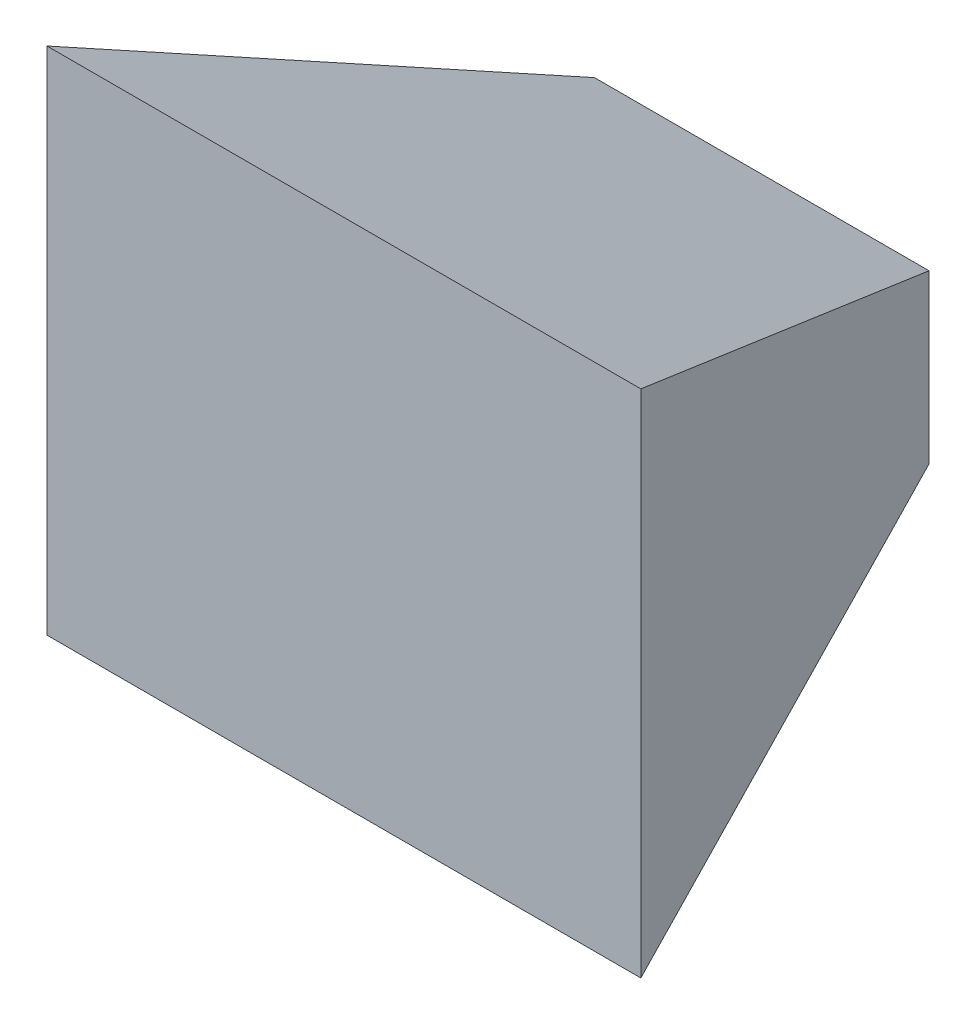
ISO-10303-21;
HEADER;
FILE_DESCRIPTION(('STEP AP214'),'2;1');
FILE_NAME('part.step','',(''),(''),'','','');
FILE_SCHEMA(('AUTOMOTIVE_DESIGN { 1 0 10303 214 1 1 1 1 }'));
ENDSEC;
DATA;
#1=APPLICATION_CONTEXT('core data for automotive mechanical design processes');
#2=APPLICATION_PROTOCOL_DEFINITION('international standard','automotive_design',2000,#1);
#3=PRODUCT_CONTEXT('',#1,'mechanical');
#4=PRODUCT('Part','Part','',(#3));
#5=PRODUCT_RELATED_PRODUCT_CATEGORY('part','',(#4));
#6=PRODUCT_DEFINITION_FORMATION('','',#4);
#7=PRODUCT_DEFINITION_CONTEXT('part definition',#1,'design');
#8=PRODUCT_DEFINITION('design','',#6,#7);
#9=PRODUCT_DEFINITION_SHAPE('','',#8);
#10=(LENGTH_UNIT() NAMED_UNIT(*) SI_UNIT(.MILLI.,.METRE.));
#11=(NAMED_UNIT(*) PLANE_ANGLE_UNIT() SI_UNIT($,.RADIAN.));
#12=(NAMED_UNIT(*) SI_UNIT($,.STERADIAN.) SOLID_ANGLE_UNIT());
#13=UNCERTAINTY_MEASURE_WITH_UNIT(LENGTH_MEASURE(1.E-05),#10,'distance_accuracy_value','');
#14=(GEOMETRIC_REPRESENTATION_CONTEXT(3) GLOBAL_UNCERTAINTY_ASSIGNED_CONTEXT((#13)) GLOBAL_UNIT_ASSIGNED_CONTEXT((#10,
#11,#12)) REPRESENTATION_CONTEXT('',''));
#15=CARTESIAN_POINT('',(0.,0.,0.));
#16=DIRECTION('',(0.,0.,1.));
#17=DIRECTION('',(1.,0.,0.));
#18=AXIS2_PLACEMENT_3D('',#15,#16,#17);
#19=CARTESIAN_POINT('',(177.5,50.,-249.787409610653));
#20=DIRECTION('',(0.,-0.925138554113529,0.37962962962963));
#21=DIRECTION('',(0.,-0.37962962962963,-0.925138554113529));
#22=AXIS2_PLACEMENT_3D('',#19,#20,#21);
#23=PLANE('',#22);
#24=DIRECTION('',(0.27589637888379,-0.364895210781787,-0.889231507126984));
#25=VECTOR('',#24,1.);
#26=CARTESIAN_POINT('',(-78.8770297029704,22.0631683168317,-317.868081014237));
#27=LINE('',#26,#25);
#28=CARTESIAN_POINT('',(-177.5,152.5,0.));
#29=VERTEX_POINT('',#28);
#30=CARTESIAN_POINT('',(-100.,50.,-249.787409610653));
#31=VERTEX_POINT('',#30);
#32=EDGE_CURVE('E76',#29,#31,#27,.T.);
#33=ORIENTED_EDGE('',*,*,#32,.F.);
#34=DIRECTION('',(-1.,0.,0.));
#35=VECTOR('',#34,1.);
#36=CARTESIAN_POINT('',(177.5,152.5,0.));
#37=LINE('',#36,#35);
#38=CARTESIAN_POINT('',(177.5,152.5,0.));
#39=VERTEX_POINT('',#38);
#40=EDGE_CURVE('E11',#39,#29,#37,.T.);
#41=ORIENTED_EDGE('',*,*,#40,.F.);
#42=DIRECTION('',(-0.27589637888379,-0.364895210781788,-0.889231507126984));
#43=VECTOR('',#42,1.);
#44=CARTESIAN_POINT('',(105.899207920792,57.8021782178218,-230.77388876821));
#45=LINE('',#44,#43);
#46=CARTESIAN_POINT('',(100.,50.,-249.787409610653));
#47=VERTEX_POINT('',#46);
#48=EDGE_CURVE('E52',#39,#47,#45,.T.);
#49=ORIENTED_EDGE('',*,*,#48,.T.);
#50=DIRECTION('',(-1.,0.,0.));
#51=VECTOR('',#50,1.);
#52=CARTESIAN_POINT('',(177.5,50.,-249.787409610653));
#53=LINE('',#52,#51);
#54=EDGE_CURVE('E89',#47,#31,#53,.T.);
#55=ORIENTED_EDGE('',*,*,#54,.T.);
#56=EDGE_LOOP('',(#33,#41,#49,#55));
#57=FACE_BOUND('',#56,.T.);
#58=ADVANCED_FACE('F38',(#57),#23,.F.);
#59=CARTESIAN_POINT('',(177.5,-50.,-249.787409610653));
#60=DIRECTION('',(0.,0.925138554113529,0.37962962962963));
#61=DIRECTION('',(0.,-0.37962962962963,0.925138554113529));
#62=AXIS2_PLACEMENT_3D('',#59,#60,#61);
#63=PLANE('',#62);
#64=DIRECTION('',(-0.27589637888379,-0.364895210781787,0.889231507126984));
#65=VECTOR('',#64,1.);
#66=CARTESIAN_POINT('',(-78.8770297029703,-22.0631683168317,-317.868081014237));
#67=LINE('',#66,#65);
#68=CARTESIAN_POINT('',(-100.,-50.,-249.787409610653));
#69=VERTEX_POINT('',#68);
#70=CARTESIAN_POINT('',(-177.5,-152.5,0.));
#71=VERTEX_POINT('',#70);
#72=EDGE_CURVE('E79',#69,#71,#67,.T.);
#73=ORIENTED_EDGE('',*,*,#72,.F.);
#74=DIRECTION('',(-1.,0.,0.));
#75=VECTOR('',#74,1.);
#76=CARTESIAN_POINT('',(177.5,-50.,-249.787409610653));
#77=LINE('',#76,#75);
#78=CARTESIAN_POINT('',(100.,-50.,-249.787409610653));
#79=VERTEX_POINT('',#78);
#80=EDGE_CURVE('E95',#79,#69,#77,.T.);
#81=ORIENTED_EDGE('',*,*,#80,.F.);
#82=DIRECTION('',(0.27589637888379,-0.364895210781787,0.889231507126984));
#83=VECTOR('',#82,1.);
#84=CARTESIAN_POINT('',(105.899207920792,-57.8021782178218,-230.77388876821));
#85=LINE('',#84,#83);
#86=CARTESIAN_POINT('',(177.5,-152.5,0.));
#87=VERTEX_POINT('',#86);
#88=EDGE_CURVE('E90',#79,#87,#85,.T.);
#89=ORIENTED_EDGE('',*,*,#88,.T.);
#90=DIRECTION('',(-1.,0.,0.));
#91=VECTOR('',#90,1.);
#92=CARTESIAN_POINT('',(177.5,-152.5,0.));
#93=LINE('',#92,#91);
#94=EDGE_CURVE('E46',#87,#71,#93,.T.);
#95=ORIENTED_EDGE('',*,*,#94,.T.);
#96=EDGE_LOOP('',(#73,#81,#89,#95));
#97=FACE_BOUND('',#96,.T.);
#98=ADVANCED_FACE('F102',(#97),#63,.F.);
#99=CARTESIAN_POINT('',(177.5,-50.,-249.787409610653));
#100=DIRECTION('',(0.,0.,1.));
#101=DIRECTION('',(0.,-1.,0.));
#102=AXIS2_PLACEMENT_3D('',#99,#100,#101);
#103=PLANE('',#102);
#104=DIRECTION('',(0.,1.,0.));
#105=VECTOR('',#104,1.);
#106=CARTESIAN_POINT('',(-100.,-152.5,-249.787409610653));
#107=LINE('',#106,#105);
#108=EDGE_CURVE('E107',#69,#31,#107,.T.);
#109=ORIENTED_EDGE('',*,*,#108,.T.);
#110=ORIENTED_EDGE('',*,*,#54,.F.);
#111=DIRECTION('',(0.,1.,0.));
#112=VECTOR('',#111,1.);
#113=CARTESIAN_POINT('',(100.,-152.5,-249.787409610653));
#114=LINE('',#113,#112);
#115=EDGE_CURVE('E108',#79,#47,#114,.T.);
#116=ORIENTED_EDGE('',*,*,#115,.F.);
#117=ORIENTED_EDGE('',*,*,#80,.T.);
#118=EDGE_LOOP('',(#109,#110,#116,#117));
#119=FACE_BOUND('',#118,.T.);
#120=ADVANCED_FACE('F111',(#119),#103,.F.);
#121=CARTESIAN_POINT('',(177.5,152.5,0.));
#122=DIRECTION('',(0.,0.,-1.));
#123=DIRECTION('',(-1.,0.,0.));
#124=AXIS2_PLACEMENT_3D('',#121,#122,#123);
#125=PLANE('',#124);
#126=DIRECTION('',(0.,-1.,0.));
#127=VECTOR('',#126,1.);
#128=CARTESIAN_POINT('',(-177.5,152.5,0.));
#129=LINE('',#128,#127);
#130=EDGE_CURVE('E73',#29,#71,#129,.T.);
#131=ORIENTED_EDGE('',*,*,#130,.T.);
#132=ORIENTED_EDGE('',*,*,#94,.F.);
#133=DIRECTION('',(0.,-1.,0.));
#134=VECTOR('',#133,1.);
#135=CARTESIAN_POINT('',(177.5,152.5,0.));
#136=LINE('',#135,#134);
#137=EDGE_CURVE('E83',#39,#87,#136,.T.);
#138=ORIENTED_EDGE('',*,*,#137,.F.);
#139=ORIENTED_EDGE('',*,*,#40,.T.);
#140=EDGE_LOOP('',(#131,#132,#138,#139));
#141=FACE_BOUND('',#140,.T.);
#142=ADVANCED_FACE('F92',(#141),#125,.F.);
#143=CARTESIAN_POINT('',(-161.913605628655,-152.5,-50.235936454043));
#144=DIRECTION('',(-0.955086031457575,0.,-0.296328656249476));
#145=DIRECTION('',(-0.296328656249475,0.,0.955086031457575));
#146=AXIS2_PLACEMENT_3D('',#143,#144,#145);
#147=PLANE('',#146);
#148=ORIENTED_EDGE('',*,*,#32,.T.);
#149=ORIENTED_EDGE('',*,*,#108,.F.);
#150=ORIENTED_EDGE('',*,*,#72,.T.);
#151=ORIENTED_EDGE('',*,*,#130,.F.);
#152=EDGE_LOOP('',(#148,#149,#150,#151));
#153=FACE_BOUND('',#152,.T.);
#154=ADVANCED_FACE('F75',(#153),#147,.T.);
#155=CARTESIAN_POINT('',(161.913605628655,-152.5,-50.235936454043));
#156=DIRECTION('',(-0.955086031457575,0.,0.296328656249475));
#157=DIRECTION('',(0.296328656249475,0.,0.955086031457575));
#158=AXIS2_PLACEMENT_3D('',#155,#156,#157);
#159=PLANE('',#158);
#160=ORIENTED_EDGE('',*,*,#137,.T.);
#161=ORIENTED_EDGE('',*,*,#88,.F.);
#162=ORIENTED_EDGE('',*,*,#115,.T.);
#163=ORIENTED_EDGE('',*,*,#48,.F.);
#164=EDGE_LOOP('',(#160,#161,#162,#163));
#165=FACE_BOUND('',#164,.T.);
#166=ADVANCED_FACE('F112',(#165),#159,.F.);
#167=CLOSED_SHELL('',(#58,#98,#120,#142,#154,#166));
#168=MANIFOLD_SOLID_BREP('B2',#167);
#169=ADVANCED_BREP_SHAPE_REPRESENTATION('',(#18,#168),#14);
#170=SHAPE_DEFINITION_REPRESENTATION(#9,#169);
ENDSEC;
END-ISO-10303-21;
